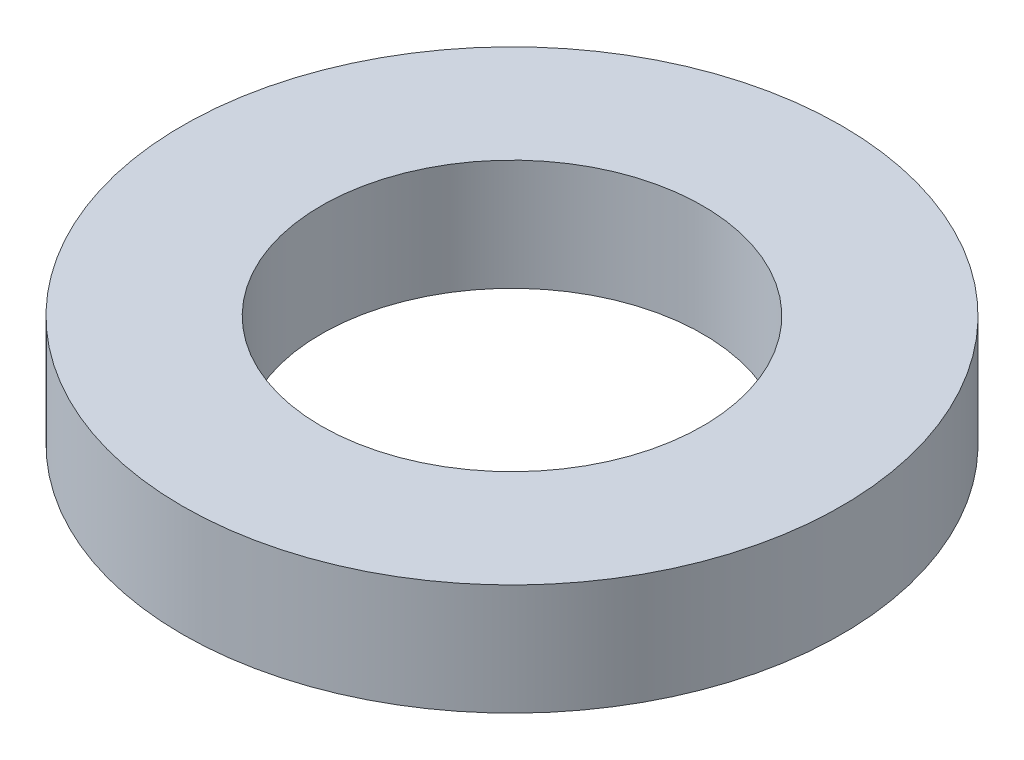
ISO-10303-21;
HEADER;
FILE_DESCRIPTION(('STEP AP214'),'2;1');
FILE_NAME('part.step','',(''),(''),'','','');
FILE_SCHEMA(('AUTOMOTIVE_DESIGN { 1 0 10303 214 1 1 1 1 }'));
ENDSEC;
DATA;
#1=APPLICATION_CONTEXT('core data for automotive mechanical design processes');
#2=APPLICATION_PROTOCOL_DEFINITION('international standard','automotive_design',2000,#1);
#3=PRODUCT_CONTEXT('',#1,'mechanical');
#4=PRODUCT('Part','Part','',(#3));
#5=PRODUCT_RELATED_PRODUCT_CATEGORY('part','',(#4));
#6=PRODUCT_DEFINITION_FORMATION('','',#4);
#7=PRODUCT_DEFINITION_CONTEXT('part definition',#1,'design');
#8=PRODUCT_DEFINITION('design','',#6,#7);
#9=PRODUCT_DEFINITION_SHAPE('','',#8);
#10=(LENGTH_UNIT() NAMED_UNIT(*) SI_UNIT(.MILLI.,.METRE.));
#11=(NAMED_UNIT(*) PLANE_ANGLE_UNIT() SI_UNIT($,.RADIAN.));
#12=(NAMED_UNIT(*) SI_UNIT($,.STERADIAN.) SOLID_ANGLE_UNIT());
#13=UNCERTAINTY_MEASURE_WITH_UNIT(LENGTH_MEASURE(1.E-05),#10,'distance_accuracy_value','');
#14=(GEOMETRIC_REPRESENTATION_CONTEXT(3) GLOBAL_UNCERTAINTY_ASSIGNED_CONTEXT((#13)) GLOBAL_UNIT_ASSIGNED_CONTEXT((#10,
#11,#12)) REPRESENTATION_CONTEXT('',''));
#15=CARTESIAN_POINT('',(0.,0.,0.));
#16=DIRECTION('',(0.,0.,1.));
#17=DIRECTION('',(1.,0.,0.));
#18=AXIS2_PLACEMENT_3D('',#15,#16,#17);
#19=CARTESIAN_POINT('',(0.,16.,0.));
#20=DIRECTION('',(0.,-1.,0.));
#21=DIRECTION('',(0.,0.,-1.));
#22=AXIS2_PLACEMENT_3D('',#19,#20,#21);
#23=CYLINDRICAL_SURFACE('',#22,47.5);
#24=CARTESIAN_POINT('',(0.,16.,0.));
#25=DIRECTION('',(0.,1.,0.));
#26=DIRECTION('',(0.,0.,1.));
#27=AXIS2_PLACEMENT_3D('',#24,#25,#26);
#28=CIRCLE('',#27,47.5);
#29=CARTESIAN_POINT('',(0.,16.,47.5));
#30=VERTEX_POINT('',#29);
#31=EDGE_CURVE('E10',#30,#30,#28,.T.);
#32=ORIENTED_EDGE('',*,*,#31,.F.);
#33=EDGE_LOOP('',(#32));
#34=FACE_BOUND('',#33,.T.);
#35=CARTESIAN_POINT('',(0.,0.,0.));
#36=DIRECTION('',(0.,1.,0.));
#37=DIRECTION('',(0.,0.,1.));
#38=AXIS2_PLACEMENT_3D('',#35,#36,#37);
#39=CIRCLE('',#38,47.5);
#40=CARTESIAN_POINT('',(0.,0.,47.5));
#41=VERTEX_POINT('',#40);
#42=EDGE_CURVE('E37',#41,#41,#39,.T.);
#43=ORIENTED_EDGE('',*,*,#42,.T.);
#44=EDGE_LOOP('',(#43));
#45=FACE_BOUND('',#44,.T.);
#46=ADVANCED_FACE('F40',(#34,#45),#23,.T.);
#47=CARTESIAN_POINT('',(0.,16.,0.));
#48=DIRECTION('',(0.,1.,0.));
#49=DIRECTION('',(0.,0.,1.));
#50=AXIS2_PLACEMENT_3D('',#47,#48,#49);
#51=PLANE('',#50);
#52=CARTESIAN_POINT('',(0.,16.,0.));
#53=DIRECTION('',(0.,1.,0.));
#54=DIRECTION('',(0.,0.,1.));
#55=AXIS2_PLACEMENT_3D('',#52,#53,#54);
#56=CIRCLE('',#55,27.5);
#57=CARTESIAN_POINT('',(0.,16.,27.5));
#58=VERTEX_POINT('',#57);
#59=EDGE_CURVE('E50',#58,#58,#56,.T.);
#60=ORIENTED_EDGE('',*,*,#59,.F.);
#61=EDGE_LOOP('',(#60));
#62=FACE_BOUND('',#61,.T.);
#63=ORIENTED_EDGE('',*,*,#31,.T.);
#64=EDGE_LOOP('',(#63));
#65=FACE_BOUND('',#64,.T.);
#66=ADVANCED_FACE('F59',(#62,#65),#51,.T.);
#67=CARTESIAN_POINT('',(0.,0.,0.));
#68=DIRECTION('',(0.,1.,0.));
#69=DIRECTION('',(0.,0.,1.));
#70=AXIS2_PLACEMENT_3D('',#67,#68,#69);
#71=PLANE('',#70);
#72=CARTESIAN_POINT('',(0.,0.,0.));
#73=DIRECTION('',(0.,1.,0.));
#74=DIRECTION('',(0.,0.,1.));
#75=AXIS2_PLACEMENT_3D('',#72,#73,#74);
#76=CIRCLE('',#75,27.5);
#77=CARTESIAN_POINT('',(0.,0.,27.5));
#78=VERTEX_POINT('',#77);
#79=EDGE_CURVE('E47',#78,#78,#76,.T.);
#80=ORIENTED_EDGE('',*,*,#79,.T.);
#81=EDGE_LOOP('',(#80));
#82=FACE_BOUND('',#81,.T.);
#83=ORIENTED_EDGE('',*,*,#42,.F.);
#84=EDGE_LOOP('',(#83));
#85=FACE_BOUND('',#84,.T.);
#86=ADVANCED_FACE('F58',(#82,#85),#71,.F.);
#87=CARTESIAN_POINT('',(0.,16.,0.));
#88=DIRECTION('',(0.,-1.,0.));
#89=DIRECTION('',(0.,0.,-1.));
#90=AXIS2_PLACEMENT_3D('',#87,#88,#89);
#91=CYLINDRICAL_SURFACE('',#90,27.5);
#92=ORIENTED_EDGE('',*,*,#59,.T.);
#93=EDGE_LOOP('',(#92));
#94=FACE_BOUND('',#93,.T.);
#95=ORIENTED_EDGE('',*,*,#79,.F.);
#96=EDGE_LOOP('',(#95));
#97=FACE_BOUND('',#96,.T.);
#98=ADVANCED_FACE('F54',(#94,#97),#91,.F.);
#99=CLOSED_SHELL('',(#46,#66,#86,#98));
#100=MANIFOLD_SOLID_BREP('B2',#99);
#101=ADVANCED_BREP_SHAPE_REPRESENTATION('',(#18,#100),#14);
#102=SHAPE_DEFINITION_REPRESENTATION(#9,#101);
ENDSEC;
END-ISO-10303-21;
